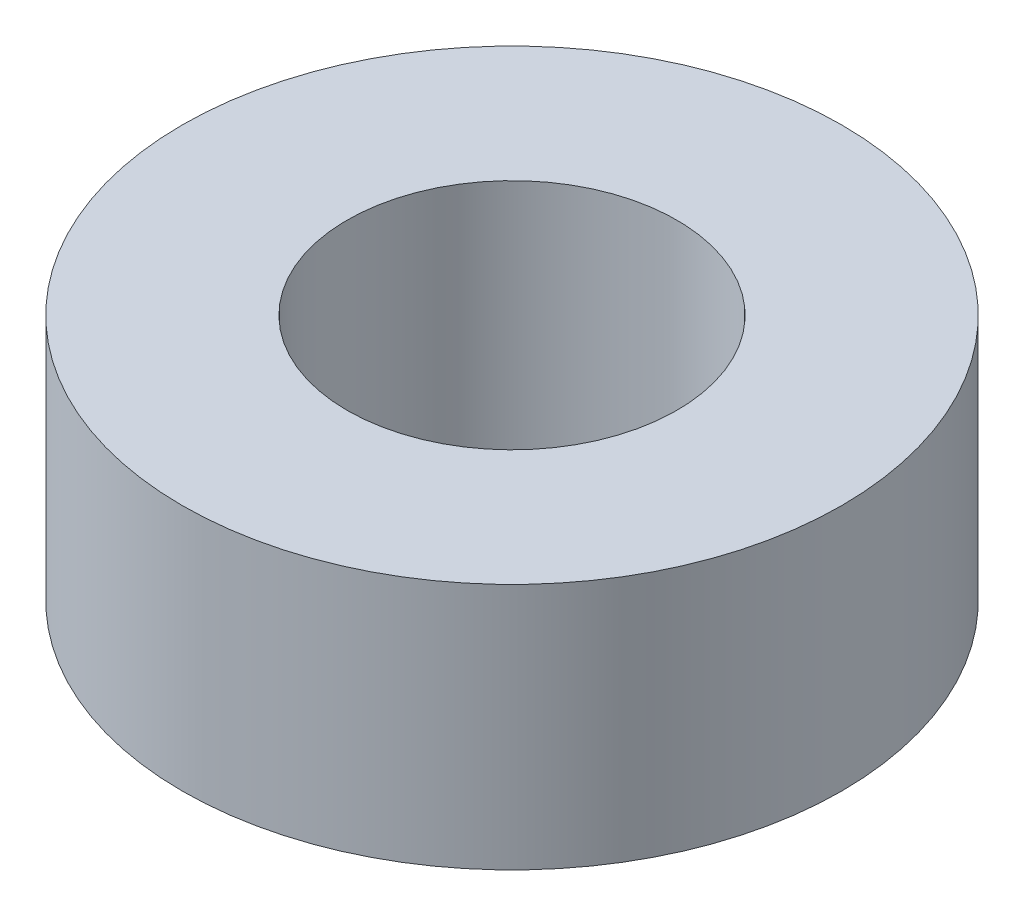
ISO-10303-21;
HEADER;
FILE_DESCRIPTION(('STEP AP214'),'2;1');
FILE_NAME('part.step','',(''),(''),'','','');
FILE_SCHEMA(('AUTOMOTIVE_DESIGN { 1 0 10303 214 1 1 1 1 }'));
ENDSEC;
DATA;
#1=APPLICATION_CONTEXT('core data for automotive mechanical design processes');
#2=APPLICATION_PROTOCOL_DEFINITION('international standard','automotive_design',2000,#1);
#3=PRODUCT_CONTEXT('',#1,'mechanical');
#4=PRODUCT('Part','Part','',(#3));
#5=PRODUCT_RELATED_PRODUCT_CATEGORY('part','',(#4));
#6=PRODUCT_DEFINITION_FORMATION('','',#4);
#7=PRODUCT_DEFINITION_CONTEXT('part definition',#1,'design');
#8=PRODUCT_DEFINITION('design','',#6,#7);
#9=PRODUCT_DEFINITION_SHAPE('','',#8);
#10=(LENGTH_UNIT() NAMED_UNIT(*) SI_UNIT(.MILLI.,.METRE.));
#11=(NAMED_UNIT(*) PLANE_ANGLE_UNIT() SI_UNIT($,.RADIAN.));
#12=(NAMED_UNIT(*) SI_UNIT($,.STERADIAN.) SOLID_ANGLE_UNIT());
#13=UNCERTAINTY_MEASURE_WITH_UNIT(LENGTH_MEASURE(1.E-05),#10,'distance_accuracy_value','');
#14=(GEOMETRIC_REPRESENTATION_CONTEXT(3) GLOBAL_UNCERTAINTY_ASSIGNED_CONTEXT((#13)) GLOBAL_UNIT_ASSIGNED_CONTEXT((#10,
#11,#12)) REPRESENTATION_CONTEXT('',''));
#15=CARTESIAN_POINT('',(0.,0.,0.));
#16=DIRECTION('',(0.,0.,1.));
#17=DIRECTION('',(1.,0.,0.));
#18=AXIS2_PLACEMENT_3D('',#15,#16,#17);
#19=CARTESIAN_POINT('',(0.,3.,0.));
#20=DIRECTION('',(0.,1.,0.));
#21=DIRECTION('',(0.,0.,1.));
#22=AXIS2_PLACEMENT_3D('',#19,#20,#21);
#23=PLANE('',#22);
#24=CARTESIAN_POINT('',(0.,3.,0.));
#25=DIRECTION('',(0.,1.,0.));
#26=DIRECTION('',(0.,0.,1.));
#27=AXIS2_PLACEMENT_3D('',#24,#25,#26);
#28=CIRCLE('',#27,4.);
#29=CARTESIAN_POINT('',(0.,3.,4.));
#30=VERTEX_POINT('',#29);
#31=EDGE_CURVE('E10',#30,#30,#28,.T.);
#32=ORIENTED_EDGE('',*,*,#31,.T.);
#33=EDGE_LOOP('',(#32));
#34=FACE_BOUND('',#33,.T.);
#35=CARTESIAN_POINT('',(0.,3.,0.));
#36=DIRECTION('',(0.,1.,0.));
#37=DIRECTION('',(0.,0.,1.));
#38=AXIS2_PLACEMENT_3D('',#35,#36,#37);
#39=CIRCLE('',#38,2.);
#40=CARTESIAN_POINT('',(0.,3.,2.));
#41=VERTEX_POINT('',#40);
#42=EDGE_CURVE('E43',#41,#41,#39,.T.);
#43=ORIENTED_EDGE('',*,*,#42,.F.);
#44=EDGE_LOOP('',(#43));
#45=FACE_BOUND('',#44,.T.);
#46=ADVANCED_FACE('F32',(#34,#45),#23,.T.);
#47=CARTESIAN_POINT('',(0.,0.,0.));
#48=DIRECTION('',(0.,1.,0.));
#49=DIRECTION('',(0.,0.,1.));
#50=AXIS2_PLACEMENT_3D('',#47,#48,#49);
#51=PLANE('',#50);
#52=CARTESIAN_POINT('',(0.,0.,0.));
#53=DIRECTION('',(0.,1.,0.));
#54=DIRECTION('',(0.,0.,1.));
#55=AXIS2_PLACEMENT_3D('',#52,#53,#54);
#56=CIRCLE('',#55,4.);
#57=CARTESIAN_POINT('',(0.,0.,4.));
#58=VERTEX_POINT('',#57);
#59=EDGE_CURVE('E36',#58,#58,#56,.T.);
#60=ORIENTED_EDGE('',*,*,#59,.F.);
#61=EDGE_LOOP('',(#60));
#62=FACE_BOUND('',#61,.T.);
#63=CARTESIAN_POINT('',(0.,0.,0.));
#64=DIRECTION('',(0.,1.,0.));
#65=DIRECTION('',(0.,0.,1.));
#66=AXIS2_PLACEMENT_3D('',#63,#64,#65);
#67=CIRCLE('',#66,2.);
#68=CARTESIAN_POINT('',(0.,0.,2.));
#69=VERTEX_POINT('',#68);
#70=EDGE_CURVE('E45',#69,#69,#67,.T.);
#71=ORIENTED_EDGE('',*,*,#70,.T.);
#72=EDGE_LOOP('',(#71));
#73=FACE_BOUND('',#72,.T.);
#74=ADVANCED_FACE('F55',(#62,#73),#51,.F.);
#75=CARTESIAN_POINT('',(0.,3.,0.));
#76=DIRECTION('',(0.,-1.,0.));
#77=DIRECTION('',(0.,0.,-1.));
#78=AXIS2_PLACEMENT_3D('',#75,#76,#77);
#79=CYLINDRICAL_SURFACE('',#78,4.);
#80=ORIENTED_EDGE('',*,*,#31,.F.);
#81=EDGE_LOOP('',(#80));
#82=FACE_BOUND('',#81,.T.);
#83=ORIENTED_EDGE('',*,*,#59,.T.);
#84=EDGE_LOOP('',(#83));
#85=FACE_BOUND('',#84,.T.);
#86=ADVANCED_FACE('F34',(#82,#85),#79,.T.);
#87=CARTESIAN_POINT('',(0.,3.,0.));
#88=DIRECTION('',(0.,-1.,0.));
#89=DIRECTION('',(0.,0.,-1.));
#90=AXIS2_PLACEMENT_3D('',#87,#88,#89);
#91=CYLINDRICAL_SURFACE('',#90,2.);
#92=ORIENTED_EDGE('',*,*,#42,.T.);
#93=EDGE_LOOP('',(#92));
#94=FACE_BOUND('',#93,.T.);
#95=ORIENTED_EDGE('',*,*,#70,.F.);
#96=EDGE_LOOP('',(#95));
#97=FACE_BOUND('',#96,.T.);
#98=ADVANCED_FACE('F51',(#94,#97),#91,.F.);
#99=CLOSED_SHELL('',(#46,#74,#86,#98));
#100=MANIFOLD_SOLID_BREP('B2',#99);
#101=ADVANCED_BREP_SHAPE_REPRESENTATION('',(#18,#100),#14);
#102=SHAPE_DEFINITION_REPRESENTATION(#9,#101);
ENDSEC;
END-ISO-10303-21;
